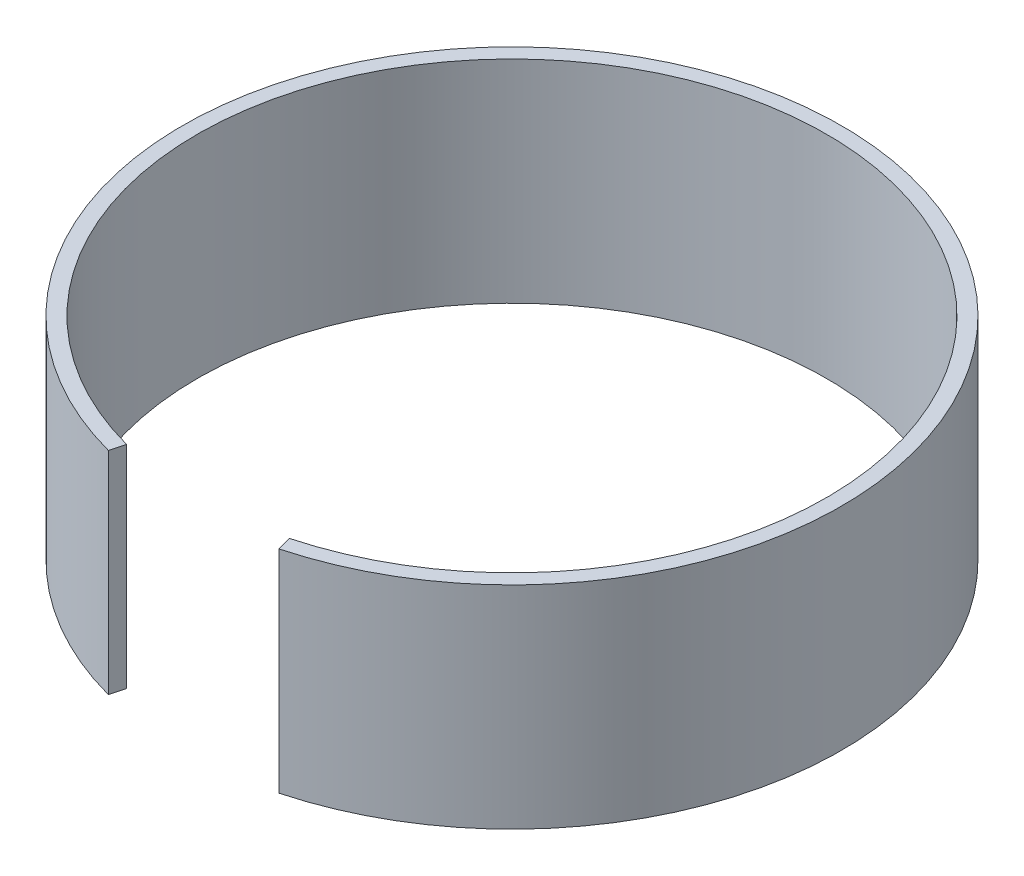
ISO-10303-21;
HEADER;
FILE_DESCRIPTION(('STEP AP214'),'2;1');
FILE_NAME('part.step','',(''),(''),'','','');
FILE_SCHEMA(('AUTOMOTIVE_DESIGN { 1 0 10303 214 1 1 1 1 }'));
ENDSEC;
DATA;
#1=APPLICATION_CONTEXT('core data for automotive mechanical design processes');
#2=APPLICATION_PROTOCOL_DEFINITION('international standard','automotive_design',2000,#1);
#3=PRODUCT_CONTEXT('',#1,'mechanical');
#4=PRODUCT('Part','Part','',(#3));
#5=PRODUCT_RELATED_PRODUCT_CATEGORY('part','',(#4));
#6=PRODUCT_DEFINITION_FORMATION('','',#4);
#7=PRODUCT_DEFINITION_CONTEXT('part definition',#1,'design');
#8=PRODUCT_DEFINITION('design','',#6,#7);
#9=PRODUCT_DEFINITION_SHAPE('','',#8);
#10=(LENGTH_UNIT() NAMED_UNIT(*) SI_UNIT(.MILLI.,.METRE.));
#11=(NAMED_UNIT(*) PLANE_ANGLE_UNIT() SI_UNIT($,.RADIAN.));
#12=(NAMED_UNIT(*) SI_UNIT($,.STERADIAN.) SOLID_ANGLE_UNIT());
#13=UNCERTAINTY_MEASURE_WITH_UNIT(LENGTH_MEASURE(1.E-05),#10,'distance_accuracy_value','');
#14=(GEOMETRIC_REPRESENTATION_CONTEXT(3) GLOBAL_UNCERTAINTY_ASSIGNED_CONTEXT((#13)) GLOBAL_UNIT_ASSIGNED_CONTEXT((#10,
#11,#12)) REPRESENTATION_CONTEXT('',''));
#15=CARTESIAN_POINT('',(0.,0.,0.));
#16=DIRECTION('',(0.,0.,1.));
#17=DIRECTION('',(1.,0.,0.));
#18=AXIS2_PLACEMENT_3D('',#15,#16,#17);
#19=CARTESIAN_POINT('',(4.87873900018251,0.,18.2077018255489));
#20=DIRECTION('',(-0.965925826289069,0.,0.25881904510252));
#21=DIRECTION('',(0.25881904510252,0.,0.965925826289069));
#22=AXIS2_PLACEMENT_3D('',#19,#20,#21);
#23=PLANE('',#22);
#24=DIRECTION('',(-0.25881904510252,0.,-0.965925826289069));
#25=VECTOR('',#24,1.);
#26=CARTESIAN_POINT('',(4.87873900018251,12.1,18.2077018255489));
#27=LINE('',#26,#25);
#28=CARTESIAN_POINT('',(4.87873900018251,12.1,18.2077018255489));
#29=VERTEX_POINT('',#28);
#30=CARTESIAN_POINT('',(4.65874281184537,12.1,17.3866648732032));
#31=VERTEX_POINT('',#30);
#32=EDGE_CURVE('E9',#29,#31,#27,.T.);
#33=ORIENTED_EDGE('',*,*,#32,.T.);
#34=DIRECTION('',(0.,1.,0.));
#35=VECTOR('',#34,1.);
#36=CARTESIAN_POINT('',(4.65874281184537,0.,17.3866648732032));
#37=LINE('',#36,#35);
#38=CARTESIAN_POINT('',(4.65874281184537,0.,17.3866648732032));
#39=VERTEX_POINT('',#38);
#40=EDGE_CURVE('E34',#39,#31,#37,.T.);
#41=ORIENTED_EDGE('',*,*,#40,.F.);
#42=DIRECTION('',(0.25881904510252,0.,0.965925826289069));
#43=VECTOR('',#42,1.);
#44=CARTESIAN_POINT('',(4.65874281184537,0.,17.3866648732032));
#45=LINE('',#44,#43);
#46=CARTESIAN_POINT('',(4.87873900018251,0.,18.2077018255489));
#47=VERTEX_POINT('',#46);
#48=EDGE_CURVE('E25',#39,#47,#45,.T.);
#49=ORIENTED_EDGE('',*,*,#48,.T.);
#50=DIRECTION('',(0.,1.,0.));
#51=VECTOR('',#50,1.);
#52=CARTESIAN_POINT('',(4.87873900018251,0.,18.2077018255489));
#53=LINE('',#52,#51);
#54=EDGE_CURVE('E74',#47,#29,#53,.T.);
#55=ORIENTED_EDGE('',*,*,#54,.T.);
#56=EDGE_LOOP('',(#33,#41,#49,#55));
#57=FACE_BOUND('',#56,.T.);
#58=ADVANCED_FACE('F15',(#57),#23,.T.);
#59=CARTESIAN_POINT('',(0.,0.,0.));
#60=DIRECTION('',(0.,1.,0.));
#61=DIRECTION('',(1.,0.,0.));
#62=AXIS2_PLACEMENT_3D('',#59,#60,#61);
#63=CYLINDRICAL_SURFACE('',#62,18.);
#64=CARTESIAN_POINT('',(0.,12.1,0.));
#65=DIRECTION('',(0.,1.,0.));
#66=DIRECTION('',(1.,0.,0.));
#67=AXIS2_PLACEMENT_3D('',#64,#65,#66);
#68=CIRCLE('',#67,18.);
#69=CARTESIAN_POINT('',(-4.65874281184537,12.1,17.3866648732032));
#70=VERTEX_POINT('',#69);
#71=EDGE_CURVE('E80',#31,#70,#68,.T.);
#72=ORIENTED_EDGE('',*,*,#71,.T.);
#73=DIRECTION('',(0.,1.,0.));
#74=VECTOR('',#73,1.);
#75=CARTESIAN_POINT('',(-4.65874281184537,0.,17.3866648732032));
#76=LINE('',#75,#74);
#77=CARTESIAN_POINT('',(-4.65874281184537,0.,17.3866648732032));
#78=VERTEX_POINT('',#77);
#79=EDGE_CURVE('E70',#78,#70,#76,.T.);
#80=ORIENTED_EDGE('',*,*,#79,.F.);
#81=CARTESIAN_POINT('',(0.,0.,0.));
#82=DIRECTION('',(0.,-1.,0.));
#83=DIRECTION('',(0.,0.,-1.));
#84=AXIS2_PLACEMENT_3D('',#81,#82,#83);
#85=CIRCLE('',#84,18.);
#86=EDGE_CURVE('E69',#78,#39,#85,.T.);
#87=ORIENTED_EDGE('',*,*,#86,.T.);
#88=ORIENTED_EDGE('',*,*,#40,.T.);
#89=EDGE_LOOP('',(#72,#80,#87,#88));
#90=FACE_BOUND('',#89,.T.);
#91=ADVANCED_FACE('F17',(#90),#63,.F.);
#92=CARTESIAN_POINT('',(-4.65874281184537,0.,17.3866648732032));
#93=DIRECTION('',(0.965925826289068,0.,0.258819045102523));
#94=DIRECTION('',(0.258819045102523,0.,-0.965925826289068));
#95=AXIS2_PLACEMENT_3D('',#92,#93,#94);
#96=PLANE('',#95);
#97=DIRECTION('',(-0.258819045102523,0.,0.965925826289068));
#98=VECTOR('',#97,1.);
#99=CARTESIAN_POINT('',(-4.65874281184537,12.1,17.3866648732032));
#100=LINE('',#99,#98);
#101=CARTESIAN_POINT('',(-4.87873900018252,12.1,18.2077018255489));
#102=VERTEX_POINT('',#101);
#103=EDGE_CURVE('E61',#70,#102,#100,.T.);
#104=ORIENTED_EDGE('',*,*,#103,.T.);
#105=DIRECTION('',(0.,1.,0.));
#106=VECTOR('',#105,1.);
#107=CARTESIAN_POINT('',(-4.87873900018252,0.,18.2077018255489));
#108=LINE('',#107,#106);
#109=CARTESIAN_POINT('',(-4.87873900018252,0.,18.2077018255489));
#110=VERTEX_POINT('',#109);
#111=EDGE_CURVE('E53',#110,#102,#108,.T.);
#112=ORIENTED_EDGE('',*,*,#111,.F.);
#113=DIRECTION('',(0.258819045102523,0.,-0.965925826289068));
#114=VECTOR('',#113,1.);
#115=CARTESIAN_POINT('',(-4.87873900018252,0.,18.2077018255489));
#116=LINE('',#115,#114);
#117=EDGE_CURVE('E59',#110,#78,#116,.T.);
#118=ORIENTED_EDGE('',*,*,#117,.T.);
#119=ORIENTED_EDGE('',*,*,#79,.T.);
#120=EDGE_LOOP('',(#104,#112,#118,#119));
#121=FACE_BOUND('',#120,.T.);
#122=ADVANCED_FACE('F58',(#121),#96,.T.);
#123=CARTESIAN_POINT('',(0.,0.,0.));
#124=DIRECTION('',(0.,1.,0.));
#125=DIRECTION('',(1.,0.,0.));
#126=AXIS2_PLACEMENT_3D('',#123,#124,#125);
#127=CYLINDRICAL_SURFACE('',#126,18.85);
#128=CARTESIAN_POINT('',(0.,12.1,0.));
#129=DIRECTION('',(0.,-1.,0.));
#130=DIRECTION('',(0.,0.,-1.));
#131=AXIS2_PLACEMENT_3D('',#128,#129,#130);
#132=CIRCLE('',#131,18.85);
#133=EDGE_CURVE('E76',#102,#29,#132,.T.);
#134=ORIENTED_EDGE('',*,*,#133,.T.);
#135=ORIENTED_EDGE('',*,*,#54,.F.);
#136=CARTESIAN_POINT('',(0.,0.,0.));
#137=DIRECTION('',(0.,1.,0.));
#138=DIRECTION('',(1.,0.,0.));
#139=AXIS2_PLACEMENT_3D('',#136,#137,#138);
#140=CIRCLE('',#139,18.85);
#141=EDGE_CURVE('E19',#47,#110,#140,.T.);
#142=ORIENTED_EDGE('',*,*,#141,.T.);
#143=ORIENTED_EDGE('',*,*,#111,.T.);
#144=EDGE_LOOP('',(#134,#135,#142,#143));
#145=FACE_BOUND('',#144,.T.);
#146=ADVANCED_FACE('F72',(#145),#127,.T.);
#147=CARTESIAN_POINT('',(0.,12.1,0.));
#148=DIRECTION('',(0.,1.,0.));
#149=DIRECTION('',(0.,0.,1.));
#150=AXIS2_PLACEMENT_3D('',#147,#148,#149);
#151=PLANE('',#150);
#152=ORIENTED_EDGE('',*,*,#32,.F.);
#153=ORIENTED_EDGE('',*,*,#133,.F.);
#154=ORIENTED_EDGE('',*,*,#103,.F.);
#155=ORIENTED_EDGE('',*,*,#71,.F.);
#156=EDGE_LOOP('',(#152,#153,#154,#155));
#157=FACE_BOUND('',#156,.T.);
#158=ADVANCED_FACE('F89',(#157),#151,.T.);
#159=CARTESIAN_POINT('',(0.,0.,0.));
#160=DIRECTION('',(0.,1.,0.));
#161=DIRECTION('',(0.,0.,1.));
#162=AXIS2_PLACEMENT_3D('',#159,#160,#161);
#163=PLANE('',#162);
#164=ORIENTED_EDGE('',*,*,#141,.F.);
#165=ORIENTED_EDGE('',*,*,#48,.F.);
#166=ORIENTED_EDGE('',*,*,#86,.F.);
#167=ORIENTED_EDGE('',*,*,#117,.F.);
#168=EDGE_LOOP('',(#164,#165,#166,#167));
#169=FACE_BOUND('',#168,.T.);
#170=ADVANCED_FACE('F67',(#169),#163,.F.);
#171=CLOSED_SHELL('',(#58,#91,#122,#146,#158,#170));
#172=MANIFOLD_SOLID_BREP('B1',#171);
#173=ADVANCED_BREP_SHAPE_REPRESENTATION('',(#18,#172),#14);
#174=SHAPE_DEFINITION_REPRESENTATION(#9,#173);
ENDSEC;
END-ISO-10303-21;
